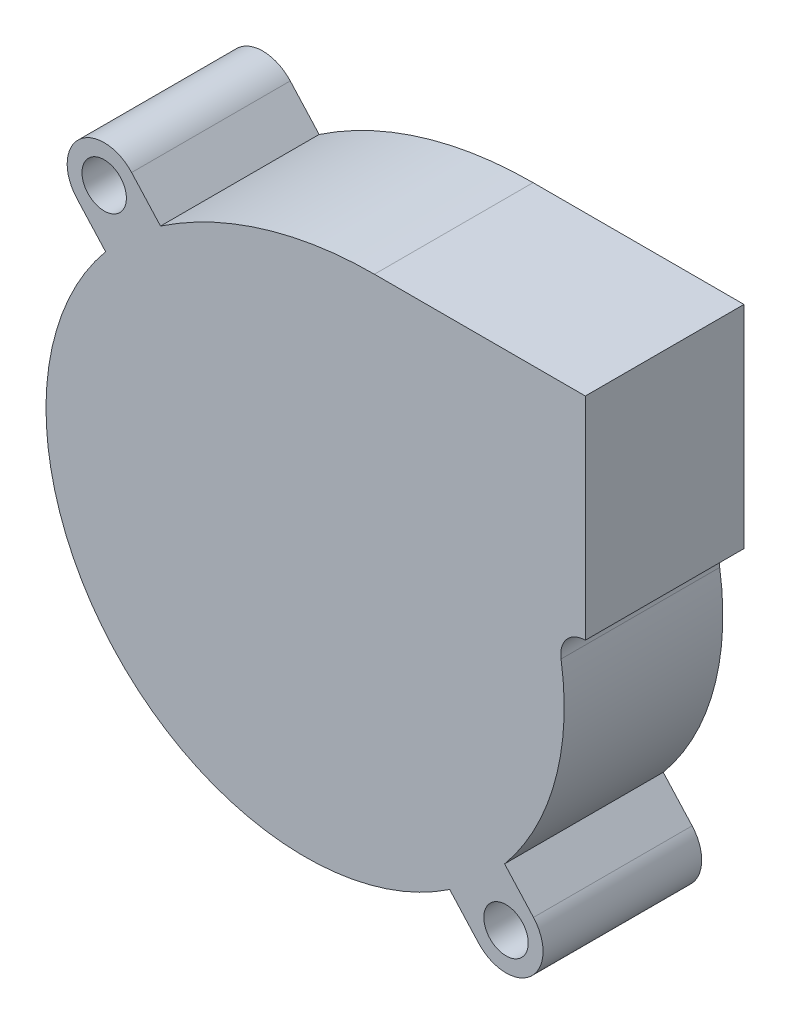
ISO-10303-21;
HEADER;
FILE_DESCRIPTION(('STEP AP214'),'2;1');
FILE_NAME('part.step','',(''),(''),'','','');
FILE_SCHEMA(('AUTOMOTIVE_DESIGN { 1 0 10303 214 1 1 1 1 }'));
ENDSEC;
DATA;
#1=APPLICATION_CONTEXT('core data for automotive mechanical design processes');
#2=APPLICATION_PROTOCOL_DEFINITION('international standard','automotive_design',2000,#1);
#3=PRODUCT_CONTEXT('',#1,'mechanical');
#4=PRODUCT('Part','Part','',(#3));
#5=PRODUCT_RELATED_PRODUCT_CATEGORY('part','',(#4));
#6=PRODUCT_DEFINITION_FORMATION('','',#4);
#7=PRODUCT_DEFINITION_CONTEXT('part definition',#1,'design');
#8=PRODUCT_DEFINITION('design','',#6,#7);
#9=PRODUCT_DEFINITION_SHAPE('','',#8);
#10=(LENGTH_UNIT() NAMED_UNIT(*) SI_UNIT(.MILLI.,.METRE.));
#11=(NAMED_UNIT(*) PLANE_ANGLE_UNIT() SI_UNIT($,.RADIAN.));
#12=(NAMED_UNIT(*) SI_UNIT($,.STERADIAN.) SOLID_ANGLE_UNIT());
#13=UNCERTAINTY_MEASURE_WITH_UNIT(LENGTH_MEASURE(1.E-05),#10,'distance_accuracy_value','');
#14=(GEOMETRIC_REPRESENTATION_CONTEXT(3) GLOBAL_UNCERTAINTY_ASSIGNED_CONTEXT((#13)) GLOBAL_UNIT_ASSIGNED_CONTEXT((#10,
#11,#12)) REPRESENTATION_CONTEXT('',''));
#15=CARTESIAN_POINT('',(0.,0.,0.));
#16=DIRECTION('',(0.,0.,1.));
#17=DIRECTION('',(1.,0.,0.));
#18=AXIS2_PLACEMENT_3D('',#15,#16,#17);
#19=CARTESIAN_POINT('',(0.,0.,15.));
#20=DIRECTION('',(0.,0.,1.));
#21=DIRECTION('',(1.,0.,0.));
#22=AXIS2_PLACEMENT_3D('',#19,#20,#21);
#23=PLANE('',#22);
#24=CARTESIAN_POINT('',(-19.,21.,15.));
#25=DIRECTION('',(0.,0.,1.));
#26=DIRECTION('',(1.,0.,0.));
#27=AXIS2_PLACEMENT_3D('',#24,#25,#26);
#28=CIRCLE('',#27,2.1);
#29=CARTESIAN_POINT('',(-16.9,21.,15.));
#30=VERTEX_POINT('',#29);
#31=EDGE_CURVE('E161',#30,#30,#28,.T.);
#32=ORIENTED_EDGE('',*,*,#31,.F.);
#33=EDGE_LOOP('',(#32));
#34=FACE_BOUND('',#33,.T.);
#35=CARTESIAN_POINT('',(0.,0.,15.));
#36=DIRECTION('',(0.,0.,1.));
#37=DIRECTION('',(1.,0.,0.));
#38=AXIS2_PLACEMENT_3D('',#35,#36,#37);
#39=CIRCLE('',#38,24.5);
#40=CARTESIAN_POINT('',(-18.8641587311854,15.6330903971237,15.));
#41=VERTEX_POINT('',#40);
#42=CARTESIAN_POINT('',(13.673408277319,-20.3294836649076,15.));
#43=VERTEX_POINT('',#42);
#44=EDGE_CURVE('E180',#41,#43,#39,.T.);
#45=ORIENTED_EDGE('',*,*,#44,.T.);
#46=DIRECTION('',(0.670913323969128,-0.74153577912377,0.));
#47=VECTOR('',#46,1.);
#48=CARTESIAN_POINT('',(13.673408277319,-20.3294836649076,15.));
#49=LINE('',#48,#47);
#50=CARTESIAN_POINT('',(16.4046247730668,-23.3481966338919,15.));
#51=VERTEX_POINT('',#50);
#52=EDGE_CURVE('E108',#43,#51,#49,.T.);
#53=ORIENTED_EDGE('',*,*,#52,.T.);
#54=CARTESIAN_POINT('',(19.,-21.,15.));
#55=DIRECTION('',(0.,0.,1.));
#56=DIRECTION('',(1.,0.,0.));
#57=AXIS2_PLACEMENT_3D('',#54,#55,#56);
#58=CIRCLE('',#57,3.5);
#59=CARTESIAN_POINT('',(21.5953752269332,-18.651803366108,15.));
#60=VERTEX_POINT('',#59);
#61=EDGE_CURVE('E207',#51,#60,#58,.T.);
#62=ORIENTED_EDGE('',*,*,#61,.T.);
#63=DIRECTION('',(-0.670913323969127,0.74153577912377,0.));
#64=VECTOR('',#63,1.);
#65=CARTESIAN_POINT('',(21.5953752269332,-18.651803366108,15.));
#66=LINE('',#65,#64);
#67=CARTESIAN_POINT('',(18.8641587311854,-15.6330903971237,15.));
#68=VERTEX_POINT('',#67);
#69=EDGE_CURVE('E226',#60,#68,#66,.T.);
#70=ORIENTED_EDGE('',*,*,#69,.T.);
#71=CARTESIAN_POINT('',(0.,0.,15.));
#72=DIRECTION('',(0.,0.,1.));
#73=DIRECTION('',(1.,0.,0.));
#74=AXIS2_PLACEMENT_3D('',#71,#72,#73);
#75=CIRCLE('',#74,24.5);
#76=CARTESIAN_POINT('',(24.201713512701,3.8114384488201,15.));
#77=VERTEX_POINT('',#76);
#78=EDGE_CURVE('E223',#68,#77,#75,.T.);
#79=ORIENTED_EDGE('',*,*,#78,.T.);
#80=CARTESIAN_POINT('',(26.5,4.17338709677421,15.));
#81=DIRECTION('',(0.,0.,-1.));
#82=DIRECTION('',(1.,0.,0.));
#83=AXIS2_PLACEMENT_3D('',#80,#81,#82);
#84=CIRCLE('',#83,2.3266129032258);
#85=CARTESIAN_POINT('',(26.5,6.5,15.));
#86=VERTEX_POINT('',#85);
#87=EDGE_CURVE('E225',#77,#86,#84,.T.);
#88=ORIENTED_EDGE('',*,*,#87,.T.);
#89=DIRECTION('',(0.,1.,0.));
#90=VECTOR('',#89,1.);
#91=CARTESIAN_POINT('',(26.5,26.5,15.));
#92=LINE('',#91,#90);
#93=CARTESIAN_POINT('',(26.5,26.5,15.));
#94=VERTEX_POINT('',#93);
#95=EDGE_CURVE('E228',#86,#94,#92,.T.);
#96=ORIENTED_EDGE('',*,*,#95,.T.);
#97=DIRECTION('',(-1.,0.,0.));
#98=VECTOR('',#97,1.);
#99=CARTESIAN_POINT('',(26.5,26.5,15.));
#100=LINE('',#99,#98);
#101=CARTESIAN_POINT('',(6.55717766275858,26.5,15.));
#102=VERTEX_POINT('',#101);
#103=EDGE_CURVE('E234',#94,#102,#100,.T.);
#104=ORIENTED_EDGE('',*,*,#103,.T.);
#105=CARTESIAN_POINT('',(6.55717766275858,-9.74914472524507,15.));
#106=DIRECTION('',(0.,0.,1.));
#107=DIRECTION('',(1.,0.,0.));
#108=AXIS2_PLACEMENT_3D('',#105,#106,#107);
#109=CIRCLE('',#108,36.2491447252451);
#110=CARTESIAN_POINT('',(-13.6734082773191,20.3294836649076,15.));
#111=VERTEX_POINT('',#110);
#112=EDGE_CURVE('E139',#102,#111,#109,.T.);
#113=ORIENTED_EDGE('',*,*,#112,.T.);
#114=DIRECTION('',(-0.670913323969128,0.74153577912377,0.));
#115=VECTOR('',#114,1.);
#116=CARTESIAN_POINT('',(-13.6734082773191,20.3294836649076,15.));
#117=LINE('',#116,#115);
#118=CARTESIAN_POINT('',(-16.4046247730668,23.3481966338919,15.));
#119=VERTEX_POINT('',#118);
#120=EDGE_CURVE('E133',#111,#119,#117,.T.);
#121=ORIENTED_EDGE('',*,*,#120,.T.);
#122=CARTESIAN_POINT('',(-19.,21.,15.));
#123=DIRECTION('',(0.,0.,1.));
#124=DIRECTION('',(1.,0.,0.));
#125=AXIS2_PLACEMENT_3D('',#122,#123,#124);
#126=CIRCLE('',#125,3.49999999999999);
#127=CARTESIAN_POINT('',(-21.5953752269332,18.6518033661081,15.));
#128=VERTEX_POINT('',#127);
#129=EDGE_CURVE('E137',#119,#128,#126,.T.);
#130=ORIENTED_EDGE('',*,*,#129,.T.);
#131=DIRECTION('',(0.670913323969127,-0.741535779123771,0.));
#132=VECTOR('',#131,1.);
#133=CARTESIAN_POINT('',(-21.5953752269332,18.6518033661081,15.));
#134=LINE('',#133,#132);
#135=EDGE_CURVE('E53',#128,#41,#134,.T.);
#136=ORIENTED_EDGE('',*,*,#135,.T.);
#137=EDGE_LOOP('',(#45,#53,#62,#70,#79,#88,#96,#104,#113,#121,#130,#136));
#138=FACE_BOUND('',#137,.T.);
#139=CARTESIAN_POINT('',(19.,-21.,15.));
#140=DIRECTION('',(0.,0.,1.));
#141=DIRECTION('',(1.,0.,0.));
#142=AXIS2_PLACEMENT_3D('',#139,#140,#141);
#143=CIRCLE('',#142,2.1);
#144=CARTESIAN_POINT('',(21.1,-21.,15.));
#145=VERTEX_POINT('',#144);
#146=EDGE_CURVE('E277',#145,#145,#143,.T.);
#147=ORIENTED_EDGE('',*,*,#146,.F.);
#148=EDGE_LOOP('',(#147));
#149=FACE_BOUND('',#148,.T.);
#150=ADVANCED_FACE('F36',(#34,#138,#149),#23,.T.);
#151=CARTESIAN_POINT('',(0.,0.,0.));
#152=DIRECTION('',(0.,0.,1.));
#153=DIRECTION('',(1.,0.,0.));
#154=AXIS2_PLACEMENT_3D('',#151,#152,#153);
#155=PLANE('',#154);
#156=CARTESIAN_POINT('',(-19.,21.,0.));
#157=DIRECTION('',(0.,0.,1.));
#158=DIRECTION('',(1.,0.,0.));
#159=AXIS2_PLACEMENT_3D('',#156,#157,#158);
#160=CIRCLE('',#159,2.1);
#161=CARTESIAN_POINT('',(-16.9,21.,0.));
#162=VERTEX_POINT('',#161);
#163=EDGE_CURVE('E282',#162,#162,#160,.T.);
#164=ORIENTED_EDGE('',*,*,#163,.T.);
#165=EDGE_LOOP('',(#164));
#166=FACE_BOUND('',#165,.T.);
#167=CARTESIAN_POINT('',(0.,0.,0.));
#168=DIRECTION('',(0.,0.,1.));
#169=DIRECTION('',(1.,0.,0.));
#170=AXIS2_PLACEMENT_3D('',#167,#168,#169);
#171=CIRCLE('',#170,24.5);
#172=CARTESIAN_POINT('',(-18.8641587311854,15.6330903971237,0.));
#173=VERTEX_POINT('',#172);
#174=CARTESIAN_POINT('',(13.673408277319,-20.3294836649076,0.));
#175=VERTEX_POINT('',#174);
#176=EDGE_CURVE('E157',#173,#175,#171,.T.);
#177=ORIENTED_EDGE('',*,*,#176,.F.);
#178=DIRECTION('',(0.670913323969127,-0.741535779123771,0.));
#179=VECTOR('',#178,1.);
#180=CARTESIAN_POINT('',(-21.5953752269332,18.6518033661081,0.));
#181=LINE('',#180,#179);
#182=CARTESIAN_POINT('',(-21.5953752269332,18.6518033661081,0.));
#183=VERTEX_POINT('',#182);
#184=EDGE_CURVE('E100',#183,#173,#181,.T.);
#185=ORIENTED_EDGE('',*,*,#184,.F.);
#186=CARTESIAN_POINT('',(-19.,21.,0.));
#187=DIRECTION('',(0.,0.,1.));
#188=DIRECTION('',(1.,0.,0.));
#189=AXIS2_PLACEMENT_3D('',#186,#187,#188);
#190=CIRCLE('',#189,3.49999999999999);
#191=CARTESIAN_POINT('',(-16.4046247730668,23.3481966338919,0.));
#192=VERTEX_POINT('',#191);
#193=EDGE_CURVE('E94',#192,#183,#190,.T.);
#194=ORIENTED_EDGE('',*,*,#193,.F.);
#195=DIRECTION('',(-0.670913323969128,0.74153577912377,0.));
#196=VECTOR('',#195,1.);
#197=CARTESIAN_POINT('',(-13.6734082773191,20.3294836649076,0.));
#198=LINE('',#197,#196);
#199=CARTESIAN_POINT('',(-13.6734082773191,20.3294836649076,0.));
#200=VERTEX_POINT('',#199);
#201=EDGE_CURVE('E147',#200,#192,#198,.T.);
#202=ORIENTED_EDGE('',*,*,#201,.F.);
#203=CARTESIAN_POINT('',(6.55717766275858,-9.74914472524507,0.));
#204=DIRECTION('',(0.,0.,1.));
#205=DIRECTION('',(1.,0.,0.));
#206=AXIS2_PLACEMENT_3D('',#203,#204,#205);
#207=CIRCLE('',#206,36.2491447252451);
#208=CARTESIAN_POINT('',(6.55717766275858,26.5,0.));
#209=VERTEX_POINT('',#208);
#210=EDGE_CURVE('E175',#209,#200,#207,.T.);
#211=ORIENTED_EDGE('',*,*,#210,.F.);
#212=DIRECTION('',(-1.,0.,0.));
#213=VECTOR('',#212,1.);
#214=CARTESIAN_POINT('',(26.5,26.5,0.));
#215=LINE('',#214,#213);
#216=CARTESIAN_POINT('',(26.5,26.5,0.));
#217=VERTEX_POINT('',#216);
#218=EDGE_CURVE('E173',#217,#209,#215,.T.);
#219=ORIENTED_EDGE('',*,*,#218,.F.);
#220=DIRECTION('',(0.,1.,0.));
#221=VECTOR('',#220,1.);
#222=CARTESIAN_POINT('',(26.5,26.5,0.));
#223=LINE('',#222,#221);
#224=CARTESIAN_POINT('',(26.5,6.5,0.));
#225=VERTEX_POINT('',#224);
#226=EDGE_CURVE('E171',#225,#217,#223,.T.);
#227=ORIENTED_EDGE('',*,*,#226,.F.);
#228=CARTESIAN_POINT('',(26.5,4.17338709677421,0.));
#229=DIRECTION('',(0.,0.,-1.));
#230=DIRECTION('',(1.,0.,0.));
#231=AXIS2_PLACEMENT_3D('',#228,#229,#230);
#232=CIRCLE('',#231,2.3266129032258);
#233=CARTESIAN_POINT('',(24.201713512701,3.8114384488201,0.));
#234=VERTEX_POINT('',#233);
#235=EDGE_CURVE('E169',#234,#225,#232,.T.);
#236=ORIENTED_EDGE('',*,*,#235,.F.);
#237=CARTESIAN_POINT('',(0.,0.,0.));
#238=DIRECTION('',(0.,0.,1.));
#239=DIRECTION('',(1.,0.,0.));
#240=AXIS2_PLACEMENT_3D('',#237,#238,#239);
#241=CIRCLE('',#240,24.5);
#242=CARTESIAN_POINT('',(18.8641587311854,-15.6330903971237,0.));
#243=VERTEX_POINT('',#242);
#244=EDGE_CURVE('E167',#243,#234,#241,.T.);
#245=ORIENTED_EDGE('',*,*,#244,.F.);
#246=DIRECTION('',(-0.670913323969127,0.74153577912377,0.));
#247=VECTOR('',#246,1.);
#248=CARTESIAN_POINT('',(21.5953752269332,-18.651803366108,0.));
#249=LINE('',#248,#247);
#250=CARTESIAN_POINT('',(21.5953752269332,-18.651803366108,0.));
#251=VERTEX_POINT('',#250);
#252=EDGE_CURVE('E165',#251,#243,#249,.T.);
#253=ORIENTED_EDGE('',*,*,#252,.F.);
#254=CARTESIAN_POINT('',(19.,-21.,0.));
#255=DIRECTION('',(0.,0.,1.));
#256=DIRECTION('',(1.,0.,0.));
#257=AXIS2_PLACEMENT_3D('',#254,#255,#256);
#258=CIRCLE('',#257,3.5);
#259=CARTESIAN_POINT('',(16.4046247730668,-23.3481966338919,0.));
#260=VERTEX_POINT('',#259);
#261=EDGE_CURVE('E163',#260,#251,#258,.T.);
#262=ORIENTED_EDGE('',*,*,#261,.F.);
#263=DIRECTION('',(0.670913323969128,-0.74153577912377,0.));
#264=VECTOR('',#263,1.);
#265=CARTESIAN_POINT('',(13.673408277319,-20.3294836649076,0.));
#266=LINE('',#265,#264);
#267=EDGE_CURVE('E160',#175,#260,#266,.T.);
#268=ORIENTED_EDGE('',*,*,#267,.F.);
#269=EDGE_LOOP('',(#177,#185,#194,#202,#211,#219,#227,#236,#245,#253,#262,#268));
#270=FACE_BOUND('',#269,.T.);
#271=CARTESIAN_POINT('',(19.,-21.,0.));
#272=DIRECTION('',(0.,0.,1.));
#273=DIRECTION('',(1.,0.,0.));
#274=AXIS2_PLACEMENT_3D('',#271,#272,#273);
#275=CIRCLE('',#274,2.1);
#276=CARTESIAN_POINT('',(21.1,-21.,0.));
#277=VERTEX_POINT('',#276);
#278=EDGE_CURVE('E280',#277,#277,#275,.T.);
#279=ORIENTED_EDGE('',*,*,#278,.T.);
#280=EDGE_LOOP('',(#279));
#281=FACE_BOUND('',#280,.T.);
#282=ADVANCED_FACE('F211',(#166,#270,#281),#155,.F.);
#283=CARTESIAN_POINT('',(0.,0.,15.));
#284=DIRECTION('',(0.,0.,-1.));
#285=DIRECTION('',(-1.,0.,0.));
#286=AXIS2_PLACEMENT_3D('',#283,#284,#285);
#287=CYLINDRICAL_SURFACE('',#286,24.5);
#288=ORIENTED_EDGE('',*,*,#176,.T.);
#289=DIRECTION('',(0.,0.,-1.));
#290=VECTOR('',#289,1.);
#291=CARTESIAN_POINT('',(13.673408277319,-20.3294836649076,15.));
#292=LINE('',#291,#290);
#293=EDGE_CURVE('E11',#43,#175,#292,.T.);
#294=ORIENTED_EDGE('',*,*,#293,.F.);
#295=ORIENTED_EDGE('',*,*,#44,.F.);
#296=DIRECTION('',(0.,0.,-1.));
#297=VECTOR('',#296,1.);
#298=CARTESIAN_POINT('',(-18.8641587311854,15.6330903971237,15.));
#299=LINE('',#298,#297);
#300=EDGE_CURVE('E153',#41,#173,#299,.T.);
#301=ORIENTED_EDGE('',*,*,#300,.T.);
#302=EDGE_LOOP('',(#288,#294,#295,#301));
#303=FACE_BOUND('',#302,.T.);
#304=ADVANCED_FACE('F38',(#303),#287,.T.);
#305=CARTESIAN_POINT('',(13.673408277319,-20.3294836649076,15.));
#306=DIRECTION('',(0.74153577912377,0.670913323969127,0.));
#307=DIRECTION('',(-0.670913323969128,0.74153577912377,0.));
#308=AXIS2_PLACEMENT_3D('',#305,#306,#307);
#309=PLANE('',#308);
#310=ORIENTED_EDGE('',*,*,#267,.T.);
#311=DIRECTION('',(0.,0.,-1.));
#312=VECTOR('',#311,1.);
#313=CARTESIAN_POINT('',(16.4046247730668,-23.3481966338919,15.));
#314=LINE('',#313,#312);
#315=EDGE_CURVE('E45',#51,#260,#314,.T.);
#316=ORIENTED_EDGE('',*,*,#315,.F.);
#317=ORIENTED_EDGE('',*,*,#52,.F.);
#318=ORIENTED_EDGE('',*,*,#293,.T.);
#319=EDGE_LOOP('',(#310,#316,#317,#318));
#320=FACE_BOUND('',#319,.T.);
#321=ADVANCED_FACE('F375',(#320),#309,.F.);
#322=CARTESIAN_POINT('',(19.,-21.,15.));
#323=DIRECTION('',(0.,0.,-1.));
#324=DIRECTION('',(-1.,0.,0.));
#325=AXIS2_PLACEMENT_3D('',#322,#323,#324);
#326=CYLINDRICAL_SURFACE('',#325,3.5);
#327=ORIENTED_EDGE('',*,*,#261,.T.);
#328=DIRECTION('',(0.,0.,-1.));
#329=VECTOR('',#328,1.);
#330=CARTESIAN_POINT('',(21.5953752269332,-18.651803366108,15.));
#331=LINE('',#330,#329);
#332=EDGE_CURVE('E199',#60,#251,#331,.T.);
#333=ORIENTED_EDGE('',*,*,#332,.F.);
#334=ORIENTED_EDGE('',*,*,#61,.F.);
#335=ORIENTED_EDGE('',*,*,#315,.T.);
#336=EDGE_LOOP('',(#327,#333,#334,#335));
#337=FACE_BOUND('',#336,.T.);
#338=ADVANCED_FACE('F205',(#337),#326,.T.);
#339=CARTESIAN_POINT('',(21.5953752269332,-18.651803366108,15.));
#340=DIRECTION('',(-0.74153577912377,-0.670913323969127,0.));
#341=DIRECTION('',(0.670913323969128,-0.74153577912377,0.));
#342=AXIS2_PLACEMENT_3D('',#339,#340,#341);
#343=PLANE('',#342);
#344=ORIENTED_EDGE('',*,*,#252,.T.);
#345=DIRECTION('',(0.,0.,-1.));
#346=VECTOR('',#345,1.);
#347=CARTESIAN_POINT('',(18.8641587311854,-15.6330903971237,15.));
#348=LINE('',#347,#346);
#349=EDGE_CURVE('E196',#68,#243,#348,.T.);
#350=ORIENTED_EDGE('',*,*,#349,.F.);
#351=ORIENTED_EDGE('',*,*,#69,.F.);
#352=ORIENTED_EDGE('',*,*,#332,.T.);
#353=EDGE_LOOP('',(#344,#350,#351,#352));
#354=FACE_BOUND('',#353,.T.);
#355=ADVANCED_FACE('F217',(#354),#343,.F.);
#356=CARTESIAN_POINT('',(0.,0.,15.));
#357=DIRECTION('',(0.,0.,-1.));
#358=DIRECTION('',(-1.,0.,0.));
#359=AXIS2_PLACEMENT_3D('',#356,#357,#358);
#360=CYLINDRICAL_SURFACE('',#359,24.5);
#361=ORIENTED_EDGE('',*,*,#244,.T.);
#362=DIRECTION('',(0.,0.,-1.));
#363=VECTOR('',#362,1.);
#364=CARTESIAN_POINT('',(24.201713512701,3.8114384488201,15.));
#365=LINE('',#364,#363);
#366=EDGE_CURVE('E193',#77,#234,#365,.T.);
#367=ORIENTED_EDGE('',*,*,#366,.F.);
#368=ORIENTED_EDGE('',*,*,#78,.F.);
#369=ORIENTED_EDGE('',*,*,#349,.T.);
#370=EDGE_LOOP('',(#361,#367,#368,#369));
#371=FACE_BOUND('',#370,.T.);
#372=ADVANCED_FACE('F221',(#371),#360,.T.);
#373=CARTESIAN_POINT('',(26.5,4.17338709677421,15.));
#374=DIRECTION('',(0.,0.,-1.));
#375=DIRECTION('',(-1.,0.,0.));
#376=AXIS2_PLACEMENT_3D('',#373,#374,#375);
#377=CYLINDRICAL_SURFACE('',#376,2.3266129032258);
#378=ORIENTED_EDGE('',*,*,#235,.T.);
#379=DIRECTION('',(0.,0.,-1.));
#380=VECTOR('',#379,1.);
#381=CARTESIAN_POINT('',(26.5,6.5,15.));
#382=LINE('',#381,#380);
#383=EDGE_CURVE('E190',#86,#225,#382,.T.);
#384=ORIENTED_EDGE('',*,*,#383,.F.);
#385=ORIENTED_EDGE('',*,*,#87,.F.);
#386=ORIENTED_EDGE('',*,*,#366,.T.);
#387=EDGE_LOOP('',(#378,#384,#385,#386));
#388=FACE_BOUND('',#387,.T.);
#389=ADVANCED_FACE('F340',(#388),#377,.F.);
#390=CARTESIAN_POINT('',(26.5,26.5,15.));
#391=DIRECTION('',(-1.,0.,0.));
#392=DIRECTION('',(0.,-1.,0.));
#393=AXIS2_PLACEMENT_3D('',#390,#391,#392);
#394=PLANE('',#393);
#395=ORIENTED_EDGE('',*,*,#226,.T.);
#396=DIRECTION('',(0.,0.,-1.));
#397=VECTOR('',#396,1.);
#398=CARTESIAN_POINT('',(26.5,26.5,15.));
#399=LINE('',#398,#397);
#400=EDGE_CURVE('E187',#94,#217,#399,.T.);
#401=ORIENTED_EDGE('',*,*,#400,.F.);
#402=ORIENTED_EDGE('',*,*,#95,.F.);
#403=ORIENTED_EDGE('',*,*,#383,.T.);
#404=EDGE_LOOP('',(#395,#401,#402,#403));
#405=FACE_BOUND('',#404,.T.);
#406=ADVANCED_FACE('F331',(#405),#394,.F.);
#407=CARTESIAN_POINT('',(26.5,26.5,15.));
#408=DIRECTION('',(0.,-1.,0.));
#409=DIRECTION('',(1.,0.,0.));
#410=AXIS2_PLACEMENT_3D('',#407,#408,#409);
#411=PLANE('',#410);
#412=ORIENTED_EDGE('',*,*,#218,.T.);
#413=DIRECTION('',(0.,0.,-1.));
#414=VECTOR('',#413,1.);
#415=CARTESIAN_POINT('',(6.55717766275858,26.5,15.));
#416=LINE('',#415,#414);
#417=EDGE_CURVE('E184',#102,#209,#416,.T.);
#418=ORIENTED_EDGE('',*,*,#417,.F.);
#419=ORIENTED_EDGE('',*,*,#103,.F.);
#420=ORIENTED_EDGE('',*,*,#400,.T.);
#421=EDGE_LOOP('',(#412,#418,#419,#420));
#422=FACE_BOUND('',#421,.T.);
#423=ADVANCED_FACE('F240',(#422),#411,.F.);
#424=CARTESIAN_POINT('',(6.55717766275858,-9.74914472524507,15.));
#425=DIRECTION('',(0.,0.,-1.));
#426=DIRECTION('',(-1.,0.,0.));
#427=AXIS2_PLACEMENT_3D('',#424,#425,#426);
#428=CYLINDRICAL_SURFACE('',#427,36.2491447252451);
#429=ORIENTED_EDGE('',*,*,#210,.T.);
#430=DIRECTION('',(0.,0.,-1.));
#431=VECTOR('',#430,1.);
#432=CARTESIAN_POINT('',(-13.6734082773191,20.3294836649076,15.));
#433=LINE('',#432,#431);
#434=EDGE_CURVE('E148',#111,#200,#433,.T.);
#435=ORIENTED_EDGE('',*,*,#434,.F.);
#436=ORIENTED_EDGE('',*,*,#112,.F.);
#437=ORIENTED_EDGE('',*,*,#417,.T.);
#438=EDGE_LOOP('',(#429,#435,#436,#437));
#439=FACE_BOUND('',#438,.T.);
#440=ADVANCED_FACE('F244',(#439),#428,.T.);
#441=CARTESIAN_POINT('',(-13.6734082773191,20.3294836649076,15.));
#442=DIRECTION('',(-0.74153577912377,-0.670913323969128,0.));
#443=DIRECTION('',(0.670913323969128,-0.74153577912377,0.));
#444=AXIS2_PLACEMENT_3D('',#441,#442,#443);
#445=PLANE('',#444);
#446=ORIENTED_EDGE('',*,*,#201,.T.);
#447=DIRECTION('',(0.,0.,-1.));
#448=VECTOR('',#447,1.);
#449=CARTESIAN_POINT('',(-16.4046247730668,23.3481966338919,15.));
#450=LINE('',#449,#448);
#451=EDGE_CURVE('E144',#119,#192,#450,.T.);
#452=ORIENTED_EDGE('',*,*,#451,.F.);
#453=ORIENTED_EDGE('',*,*,#120,.F.);
#454=ORIENTED_EDGE('',*,*,#434,.T.);
#455=EDGE_LOOP('',(#446,#452,#453,#454));
#456=FACE_BOUND('',#455,.T.);
#457=ADVANCED_FACE('F145',(#456),#445,.F.);
#458=CARTESIAN_POINT('',(-19.,21.,15.));
#459=DIRECTION('',(0.,0.,-1.));
#460=DIRECTION('',(-1.,0.,0.));
#461=AXIS2_PLACEMENT_3D('',#458,#459,#460);
#462=CYLINDRICAL_SURFACE('',#461,3.49999999999999);
#463=ORIENTED_EDGE('',*,*,#193,.T.);
#464=DIRECTION('',(0.,0.,-1.));
#465=VECTOR('',#464,1.);
#466=CARTESIAN_POINT('',(-21.5953752269332,18.6518033661081,15.));
#467=LINE('',#466,#465);
#468=EDGE_CURVE('E149',#128,#183,#467,.T.);
#469=ORIENTED_EDGE('',*,*,#468,.F.);
#470=ORIENTED_EDGE('',*,*,#129,.F.);
#471=ORIENTED_EDGE('',*,*,#451,.T.);
#472=EDGE_LOOP('',(#463,#469,#470,#471));
#473=FACE_BOUND('',#472,.T.);
#474=ADVANCED_FACE('F151',(#473),#462,.T.);
#475=CARTESIAN_POINT('',(-21.5953752269332,18.6518033661081,15.));
#476=DIRECTION('',(0.741535779123771,0.670913323969127,0.));
#477=DIRECTION('',(-0.670913323969127,0.741535779123771,0.));
#478=AXIS2_PLACEMENT_3D('',#475,#476,#477);
#479=PLANE('',#478);
#480=ORIENTED_EDGE('',*,*,#184,.T.);
#481=ORIENTED_EDGE('',*,*,#300,.F.);
#482=ORIENTED_EDGE('',*,*,#135,.F.);
#483=ORIENTED_EDGE('',*,*,#468,.T.);
#484=EDGE_LOOP('',(#480,#481,#482,#483));
#485=FACE_BOUND('',#484,.T.);
#486=ADVANCED_FACE('F248',(#485),#479,.F.);
#487=CARTESIAN_POINT('',(-19.,21.,15.));
#488=DIRECTION('',(0.,0.,-1.));
#489=DIRECTION('',(-1.,0.,0.));
#490=AXIS2_PLACEMENT_3D('',#487,#488,#489);
#491=CYLINDRICAL_SURFACE('',#490,2.1);
#492=ORIENTED_EDGE('',*,*,#31,.T.);
#493=EDGE_LOOP('',(#492));
#494=FACE_BOUND('',#493,.T.);
#495=ORIENTED_EDGE('',*,*,#163,.F.);
#496=EDGE_LOOP('',(#495));
#497=FACE_BOUND('',#496,.T.);
#498=ADVANCED_FACE('F250',(#494,#497),#491,.F.);
#499=CARTESIAN_POINT('',(19.,-21.,15.));
#500=DIRECTION('',(0.,0.,-1.));
#501=DIRECTION('',(-1.,0.,0.));
#502=AXIS2_PLACEMENT_3D('',#499,#500,#501);
#503=CYLINDRICAL_SURFACE('',#502,2.1);
#504=ORIENTED_EDGE('',*,*,#146,.T.);
#505=EDGE_LOOP('',(#504));
#506=FACE_BOUND('',#505,.T.);
#507=ORIENTED_EDGE('',*,*,#278,.F.);
#508=EDGE_LOOP('',(#507));
#509=FACE_BOUND('',#508,.T.);
#510=ADVANCED_FACE('F256',(#506,#509),#503,.F.);
#511=CLOSED_SHELL('',(#150,#282,#304,#321,#338,#355,#372,#389,#406,#423,#440,#457,#474,#486,
#498,#510));
#512=MANIFOLD_SOLID_BREP('B2',#511);
#513=ADVANCED_BREP_SHAPE_REPRESENTATION('',(#18,#512),#14);
#514=SHAPE_DEFINITION_REPRESENTATION(#9,#513);
ENDSEC;
END-ISO-10303-21;
